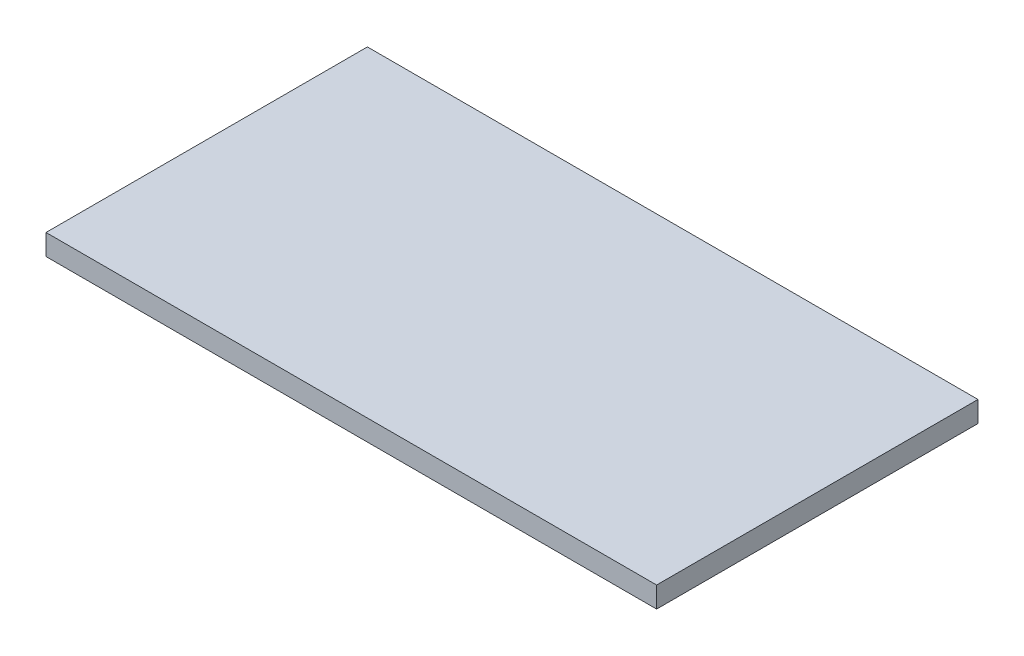
ISO-10303-21;
HEADER;
FILE_DESCRIPTION(('STEP AP214'),'2;1');
FILE_NAME('part.step','',(''),(''),'','','');
FILE_SCHEMA(('AUTOMOTIVE_DESIGN { 1 0 10303 214 1 1 1 1 }'));
ENDSEC;
DATA;
#1=APPLICATION_CONTEXT('core data for automotive mechanical design processes');
#2=APPLICATION_PROTOCOL_DEFINITION('international standard','automotive_design',2000,#1);
#3=PRODUCT_CONTEXT('',#1,'mechanical');
#4=PRODUCT('Part','Part','',(#3));
#5=PRODUCT_RELATED_PRODUCT_CATEGORY('part','',(#4));
#6=PRODUCT_DEFINITION_FORMATION('','',#4);
#7=PRODUCT_DEFINITION_CONTEXT('part definition',#1,'design');
#8=PRODUCT_DEFINITION('design','',#6,#7);
#9=PRODUCT_DEFINITION_SHAPE('','',#8);
#10=(LENGTH_UNIT() NAMED_UNIT(*) SI_UNIT(.MILLI.,.METRE.));
#11=(NAMED_UNIT(*) PLANE_ANGLE_UNIT() SI_UNIT($,.RADIAN.));
#12=(NAMED_UNIT(*) SI_UNIT($,.STERADIAN.) SOLID_ANGLE_UNIT());
#13=UNCERTAINTY_MEASURE_WITH_UNIT(LENGTH_MEASURE(1.E-05),#10,'distance_accuracy_value','');
#14=(GEOMETRIC_REPRESENTATION_CONTEXT(3) GLOBAL_UNCERTAINTY_ASSIGNED_CONTEXT((#13)) GLOBAL_UNIT_ASSIGNED_CONTEXT((#10,
#11,#12)) REPRESENTATION_CONTEXT('',''));
#15=CARTESIAN_POINT('',(0.,0.,0.));
#16=DIRECTION('',(0.,0.,1.));
#17=DIRECTION('',(1.,0.,0.));
#18=AXIS2_PLACEMENT_3D('',#15,#16,#17);
#19=CARTESIAN_POINT('',(-101.65053033262,6.35,-10.5328229506085));
#20=DIRECTION('',(1.,0.,0.));
#21=DIRECTION('',(0.,0.,-1.));
#22=AXIS2_PLACEMENT_3D('',#19,#20,#21);
#23=PLANE('',#22);
#24=DIRECTION('',(0.,0.,1.));
#25=VECTOR('',#24,1.);
#26=CARTESIAN_POINT('',(-101.65053033262,0.,-10.5328229506085));
#27=LINE('',#26,#25);
#28=CARTESIAN_POINT('',(-101.65053033262,0.,-10.5328229506085));
#29=VERTEX_POINT('',#28);
#30=CARTESIAN_POINT('',(-101.65053033262,0.,87.2893850967671));
#31=VERTEX_POINT('',#30);
#32=EDGE_CURVE('E107',#29,#31,#27,.T.);
#33=ORIENTED_EDGE('',*,*,#32,.T.);
#34=DIRECTION('',(0.,-1.,0.));
#35=VECTOR('',#34,1.);
#36=CARTESIAN_POINT('',(-101.65053033262,6.35,87.2893850967671));
#37=LINE('',#36,#35);
#38=CARTESIAN_POINT('',(-101.65053033262,6.35,87.2893850967671));
#39=VERTEX_POINT('',#38);
#40=EDGE_CURVE('E11',#39,#31,#37,.T.);
#41=ORIENTED_EDGE('',*,*,#40,.F.);
#42=DIRECTION('',(0.,0.,1.));
#43=VECTOR('',#42,1.);
#44=CARTESIAN_POINT('',(-101.65053033262,6.35,-10.5328229506085));
#45=LINE('',#44,#43);
#46=CARTESIAN_POINT('',(-101.65053033262,6.35,-10.5328229506085));
#47=VERTEX_POINT('',#46);
#48=EDGE_CURVE('E91',#47,#39,#45,.T.);
#49=ORIENTED_EDGE('',*,*,#48,.F.);
#50=DIRECTION('',(0.,-1.,0.));
#51=VECTOR('',#50,1.);
#52=CARTESIAN_POINT('',(-101.65053033262,6.35,-10.5328229506085));
#53=LINE('',#52,#51);
#54=EDGE_CURVE('E103',#47,#29,#53,.T.);
#55=ORIENTED_EDGE('',*,*,#54,.T.);
#56=EDGE_LOOP('',(#33,#41,#49,#55));
#57=FACE_BOUND('',#56,.T.);
#58=ADVANCED_FACE('F39',(#57),#23,.F.);
#59=CARTESIAN_POINT('',(-101.65053033262,6.35,87.2893850967671));
#60=DIRECTION('',(0.,0.,-1.));
#61=DIRECTION('',(-1.,0.,0.));
#62=AXIS2_PLACEMENT_3D('',#59,#60,#61);
#63=PLANE('',#62);
#64=DIRECTION('',(1.,0.,0.));
#65=VECTOR('',#64,1.);
#66=CARTESIAN_POINT('',(-101.65053033262,0.,87.2893850967671));
#67=LINE('',#66,#65);
#68=CARTESIAN_POINT('',(84.2033413505874,0.,87.2893850967671));
#69=VERTEX_POINT('',#68);
#70=EDGE_CURVE('E96',#31,#69,#67,.T.);
#71=ORIENTED_EDGE('',*,*,#70,.T.);
#72=DIRECTION('',(0.,-1.,0.));
#73=VECTOR('',#72,1.);
#74=CARTESIAN_POINT('',(84.2033413505874,6.35,87.2893850967671));
#75=LINE('',#74,#73);
#76=CARTESIAN_POINT('',(84.2033413505874,6.35,87.2893850967671));
#77=VERTEX_POINT('',#76);
#78=EDGE_CURVE('E48',#77,#69,#75,.T.);
#79=ORIENTED_EDGE('',*,*,#78,.F.);
#80=DIRECTION('',(1.,0.,0.));
#81=VECTOR('',#80,1.);
#82=CARTESIAN_POINT('',(-101.65053033262,6.35,87.2893850967671));
#83=LINE('',#82,#81);
#84=EDGE_CURVE('E86',#39,#77,#83,.T.);
#85=ORIENTED_EDGE('',*,*,#84,.F.);
#86=ORIENTED_EDGE('',*,*,#40,.T.);
#87=EDGE_LOOP('',(#71,#79,#85,#86));
#88=FACE_BOUND('',#87,.T.);
#89=ADVANCED_FACE('F95',(#88),#63,.F.);
#90=CARTESIAN_POINT('',(84.2033413505874,6.35,-10.5328229506085));
#91=DIRECTION('',(-1.,0.,0.));
#92=DIRECTION('',(0.,0.,1.));
#93=AXIS2_PLACEMENT_3D('',#90,#91,#92);
#94=PLANE('',#93);
#95=DIRECTION('',(0.,0.,-1.));
#96=VECTOR('',#95,1.);
#97=CARTESIAN_POINT('',(84.2033413505874,0.,-10.5328229506085));
#98=LINE('',#97,#96);
#99=CARTESIAN_POINT('',(84.2033413505874,0.,-10.5328229506085));
#100=VERTEX_POINT('',#99);
#101=EDGE_CURVE('E73',#69,#100,#98,.T.);
#102=ORIENTED_EDGE('',*,*,#101,.T.);
#103=DIRECTION('',(0.,-1.,0.));
#104=VECTOR('',#103,1.);
#105=CARTESIAN_POINT('',(84.2033413505874,6.35,-10.5328229506085));
#106=LINE('',#105,#104);
#107=CARTESIAN_POINT('',(84.2033413505874,6.35,-10.5328229506085));
#108=VERTEX_POINT('',#107);
#109=EDGE_CURVE('E98',#108,#100,#106,.T.);
#110=ORIENTED_EDGE('',*,*,#109,.F.);
#111=DIRECTION('',(0.,0.,-1.));
#112=VECTOR('',#111,1.);
#113=CARTESIAN_POINT('',(84.2033413505874,6.35,-10.5328229506085));
#114=LINE('',#113,#112);
#115=EDGE_CURVE('E89',#77,#108,#114,.T.);
#116=ORIENTED_EDGE('',*,*,#115,.F.);
#117=ORIENTED_EDGE('',*,*,#78,.T.);
#118=EDGE_LOOP('',(#102,#110,#116,#117));
#119=FACE_BOUND('',#118,.T.);
#120=ADVANCED_FACE('F99',(#119),#94,.F.);
#121=CARTESIAN_POINT('',(-101.65053033262,6.35,-10.5328229506085));
#122=DIRECTION('',(0.,0.,1.));
#123=DIRECTION('',(1.,0.,0.));
#124=AXIS2_PLACEMENT_3D('',#121,#122,#123);
#125=PLANE('',#124);
#126=DIRECTION('',(-1.,0.,0.));
#127=VECTOR('',#126,1.);
#128=CARTESIAN_POINT('',(-101.65053033262,0.,-10.5328229506085));
#129=LINE('',#128,#127);
#130=EDGE_CURVE('E79',#100,#29,#129,.T.);
#131=ORIENTED_EDGE('',*,*,#130,.T.);
#132=ORIENTED_EDGE('',*,*,#54,.F.);
#133=DIRECTION('',(-1.,0.,0.));
#134=VECTOR('',#133,1.);
#135=CARTESIAN_POINT('',(-101.65053033262,6.35,-10.5328229506085));
#136=LINE('',#135,#134);
#137=EDGE_CURVE('E56',#108,#47,#136,.T.);
#138=ORIENTED_EDGE('',*,*,#137,.F.);
#139=ORIENTED_EDGE('',*,*,#109,.T.);
#140=EDGE_LOOP('',(#131,#132,#138,#139));
#141=FACE_BOUND('',#140,.T.);
#142=ADVANCED_FACE('F120',(#141),#125,.F.);
#143=CARTESIAN_POINT('',(0.,6.35,0.));
#144=DIRECTION('',(0.,1.,0.));
#145=DIRECTION('',(0.,0.,1.));
#146=AXIS2_PLACEMENT_3D('',#143,#144,#145);
#147=PLANE('',#146);
#148=ORIENTED_EDGE('',*,*,#48,.T.);
#149=ORIENTED_EDGE('',*,*,#84,.T.);
#150=ORIENTED_EDGE('',*,*,#115,.T.);
#151=ORIENTED_EDGE('',*,*,#137,.T.);
#152=EDGE_LOOP('',(#148,#149,#150,#151));
#153=FACE_BOUND('',#152,.T.);
#154=ADVANCED_FACE('F87',(#153),#147,.T.);
#155=CARTESIAN_POINT('',(0.,0.,0.));
#156=DIRECTION('',(0.,1.,0.));
#157=DIRECTION('',(0.,0.,1.));
#158=AXIS2_PLACEMENT_3D('',#155,#156,#157);
#159=PLANE('',#158);
#160=ORIENTED_EDGE('',*,*,#32,.F.);
#161=ORIENTED_EDGE('',*,*,#130,.F.);
#162=ORIENTED_EDGE('',*,*,#101,.F.);
#163=ORIENTED_EDGE('',*,*,#70,.F.);
#164=EDGE_LOOP('',(#160,#161,#162,#163));
#165=FACE_BOUND('',#164,.T.);
#166=ADVANCED_FACE('F123',(#165),#159,.F.);
#167=CLOSED_SHELL('',(#58,#89,#120,#142,#154,#166));
#168=MANIFOLD_SOLID_BREP('B2',#167);
#169=ADVANCED_BREP_SHAPE_REPRESENTATION('',(#18,#168),#14);
#170=SHAPE_DEFINITION_REPRESENTATION(#9,#169);
ENDSEC;
END-ISO-10303-21;
